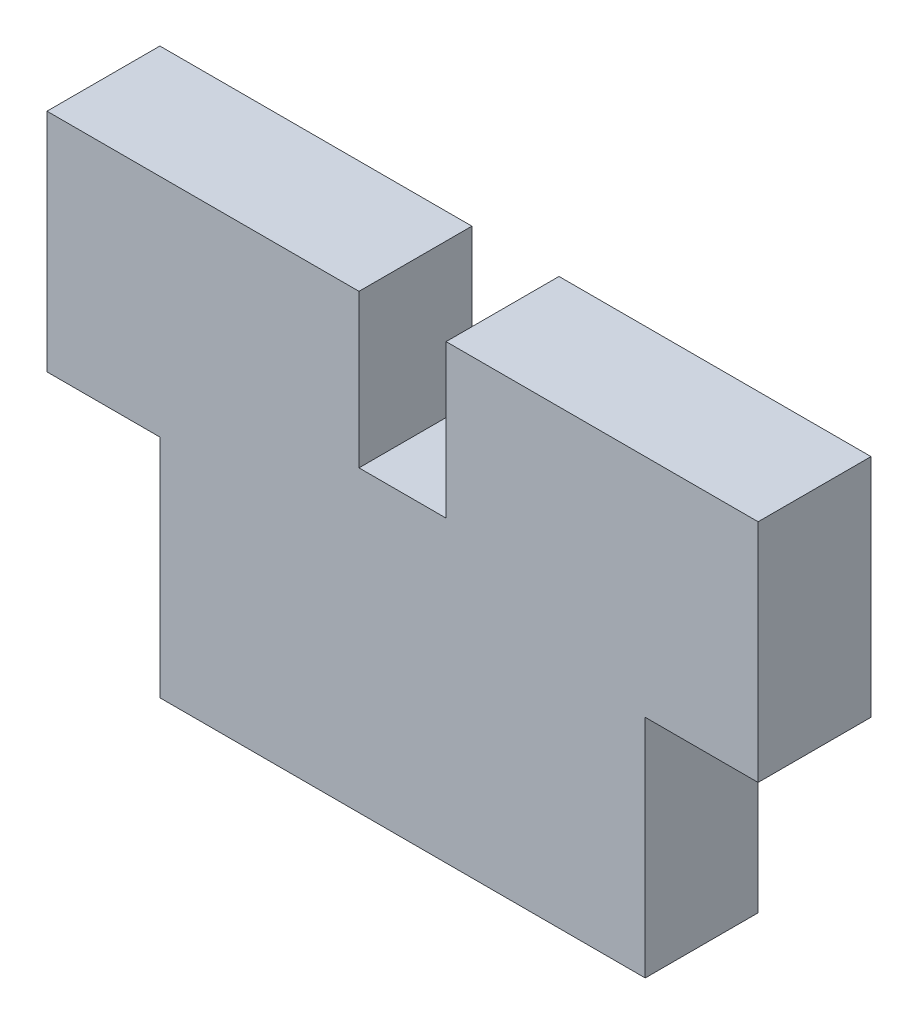
ISO-10303-21;
HEADER;
FILE_DESCRIPTION(('STEP AP214'),'2;1');
FILE_NAME('part.step','',(''),(''),'','','');
FILE_SCHEMA(('AUTOMOTIVE_DESIGN { 1 0 10303 214 1 1 1 1 }'));
ENDSEC;
DATA;
#1=APPLICATION_CONTEXT('core data for automotive mechanical design processes');
#2=APPLICATION_PROTOCOL_DEFINITION('international standard','automotive_design',2000,#1);
#3=PRODUCT_CONTEXT('',#1,'mechanical');
#4=PRODUCT('Part','Part','',(#3));
#5=PRODUCT_RELATED_PRODUCT_CATEGORY('part','',(#4));
#6=PRODUCT_DEFINITION_FORMATION('','',#4);
#7=PRODUCT_DEFINITION_CONTEXT('part definition',#1,'design');
#8=PRODUCT_DEFINITION('design','',#6,#7);
#9=PRODUCT_DEFINITION_SHAPE('','',#8);
#10=(LENGTH_UNIT() NAMED_UNIT(*) SI_UNIT(.MILLI.,.METRE.));
#11=(NAMED_UNIT(*) PLANE_ANGLE_UNIT() SI_UNIT($,.RADIAN.));
#12=(NAMED_UNIT(*) SI_UNIT($,.STERADIAN.) SOLID_ANGLE_UNIT());
#13=UNCERTAINTY_MEASURE_WITH_UNIT(LENGTH_MEASURE(1.E-05),#10,'distance_accuracy_value','');
#14=(GEOMETRIC_REPRESENTATION_CONTEXT(3) GLOBAL_UNCERTAINTY_ASSIGNED_CONTEXT((#13)) GLOBAL_UNIT_ASSIGNED_CONTEXT((#10,
#11,#12)) REPRESENTATION_CONTEXT('',''));
#15=CARTESIAN_POINT('',(0.,0.,0.));
#16=DIRECTION('',(0.,0.,1.));
#17=DIRECTION('',(1.,0.,0.));
#18=AXIS2_PLACEMENT_3D('',#15,#16,#17);
#19=CARTESIAN_POINT('',(-20.,6.35,6.35));
#20=DIRECTION('',(0.,-1.,0.));
#21=DIRECTION('',(0.,0.,-1.));
#22=AXIS2_PLACEMENT_3D('',#19,#20,#21);
#23=PLANE('',#22);
#24=DIRECTION('',(-1.,0.,0.));
#25=VECTOR('',#24,1.);
#26=CARTESIAN_POINT('',(-20.,6.35,0.));
#27=LINE('',#26,#25);
#28=CARTESIAN_POINT('',(20.,6.35,0.));
#29=VERTEX_POINT('',#28);
#30=CARTESIAN_POINT('',(2.45,6.35,0.));
#31=VERTEX_POINT('',#30);
#32=EDGE_CURVE('E200',#29,#31,#27,.T.);
#33=ORIENTED_EDGE('',*,*,#32,.T.);
#34=DIRECTION('',(0.,0.,-1.));
#35=VECTOR('',#34,1.);
#36=CARTESIAN_POINT('',(2.45,6.35,6.35));
#37=LINE('',#36,#35);
#38=CARTESIAN_POINT('',(2.45,6.35,6.35));
#39=VERTEX_POINT('',#38);
#40=EDGE_CURVE('E373',#39,#31,#37,.T.);
#41=ORIENTED_EDGE('',*,*,#40,.F.);
#42=DIRECTION('',(-1.,0.,0.));
#43=VECTOR('',#42,1.);
#44=CARTESIAN_POINT('',(-20.,6.35,6.35));
#45=LINE('',#44,#43);
#46=CARTESIAN_POINT('',(20.,6.35,6.35));
#47=VERTEX_POINT('',#46);
#48=EDGE_CURVE('E233',#47,#39,#45,.T.);
#49=ORIENTED_EDGE('',*,*,#48,.F.);
#50=DIRECTION('',(0.,0.,-1.));
#51=VECTOR('',#50,1.);
#52=CARTESIAN_POINT('',(20.,6.35,6.35));
#53=LINE('',#52,#51);
#54=EDGE_CURVE('E11',#47,#29,#53,.T.);
#55=ORIENTED_EDGE('',*,*,#54,.T.);
#56=EDGE_LOOP('',(#33,#41,#49,#55));
#57=FACE_BOUND('',#56,.T.);
#58=ADVANCED_FACE('F32',(#57),#23,.F.);
#59=CARTESIAN_POINT('',(-20.,-6.35,6.35));
#60=DIRECTION('',(0.,1.,0.));
#61=DIRECTION('',(0.,0.,1.));
#62=AXIS2_PLACEMENT_3D('',#59,#60,#61);
#63=PLANE('',#62);
#64=DIRECTION('',(0.,0.,1.));
#65=VECTOR('',#64,1.);
#66=CARTESIAN_POINT('',(13.65,-6.35,0.));
#67=LINE('',#66,#65);
#68=CARTESIAN_POINT('',(13.65,-6.35,0.));
#69=VERTEX_POINT('',#68);
#70=CARTESIAN_POINT('',(13.65,-6.35,6.35));
#71=VERTEX_POINT('',#70);
#72=EDGE_CURVE('E166',#69,#71,#67,.T.);
#73=ORIENTED_EDGE('',*,*,#72,.F.);
#74=DIRECTION('',(1.,0.,0.));
#75=VECTOR('',#74,1.);
#76=CARTESIAN_POINT('',(-20.,-6.35,0.));
#77=LINE('',#76,#75);
#78=CARTESIAN_POINT('',(20.,-6.35,0.));
#79=VERTEX_POINT('',#78);
#80=EDGE_CURVE('E209',#69,#79,#77,.T.);
#81=ORIENTED_EDGE('',*,*,#80,.T.);
#82=DIRECTION('',(0.,0.,-1.));
#83=VECTOR('',#82,1.);
#84=CARTESIAN_POINT('',(20.,-6.35,6.35));
#85=LINE('',#84,#83);
#86=CARTESIAN_POINT('',(20.,-6.35,6.35));
#87=VERTEX_POINT('',#86);
#88=EDGE_CURVE('E212',#87,#79,#85,.T.);
#89=ORIENTED_EDGE('',*,*,#88,.F.);
#90=DIRECTION('',(1.,0.,0.));
#91=VECTOR('',#90,1.);
#92=CARTESIAN_POINT('',(-20.,-6.35,6.35));
#93=LINE('',#92,#91);
#94=EDGE_CURVE('E57',#71,#87,#93,.T.);
#95=ORIENTED_EDGE('',*,*,#94,.F.);
#96=EDGE_LOOP('',(#73,#81,#89,#95));
#97=FACE_BOUND('',#96,.T.);
#98=ADVANCED_FACE('F254',(#97),#63,.F.);
#99=DIRECTION('',(0.,0.,-1.));
#100=VECTOR('',#99,1.);
#101=CARTESIAN_POINT('',(-13.65,-6.35,0.));
#102=LINE('',#101,#100);
#103=CARTESIAN_POINT('',(-13.65,-6.35,6.35));
#104=VERTEX_POINT('',#103);
#105=CARTESIAN_POINT('',(-13.65,-6.35,0.));
#106=VERTEX_POINT('',#105);
#107=EDGE_CURVE('E154',#104,#106,#102,.T.);
#108=ORIENTED_EDGE('',*,*,#107,.F.);
#109=CARTESIAN_POINT('',(-20.,-6.35,6.35));
#110=VERTEX_POINT('',#109);
#111=EDGE_CURVE('E227',#110,#104,#93,.T.);
#112=ORIENTED_EDGE('',*,*,#111,.F.);
#113=DIRECTION('',(0.,0.,-1.));
#114=VECTOR('',#113,1.);
#115=CARTESIAN_POINT('',(-20.,-6.35,6.35));
#116=LINE('',#115,#114);
#117=CARTESIAN_POINT('',(-20.,-6.35,0.));
#118=VERTEX_POINT('',#117);
#119=EDGE_CURVE('E222',#110,#118,#116,.T.);
#120=ORIENTED_EDGE('',*,*,#119,.T.);
#121=EDGE_CURVE('E218',#118,#106,#77,.T.);
#122=ORIENTED_EDGE('',*,*,#121,.T.);
#123=EDGE_LOOP('',(#108,#112,#120,#122));
#124=FACE_BOUND('',#123,.T.);
#125=ADVANCED_FACE('F245',(#124),#63,.F.);
#126=CARTESIAN_POINT('',(20.,-6.35,6.35));
#127=DIRECTION('',(-1.,0.,0.));
#128=DIRECTION('',(0.,0.,1.));
#129=AXIS2_PLACEMENT_3D('',#126,#127,#128);
#130=PLANE('',#129);
#131=DIRECTION('',(0.,1.,0.));
#132=VECTOR('',#131,1.);
#133=CARTESIAN_POINT('',(20.,-6.35,0.));
#134=LINE('',#133,#132);
#135=EDGE_CURVE('E191',#79,#29,#134,.T.);
#136=ORIENTED_EDGE('',*,*,#135,.T.);
#137=ORIENTED_EDGE('',*,*,#54,.F.);
#138=DIRECTION('',(0.,1.,0.));
#139=VECTOR('',#138,1.);
#140=CARTESIAN_POINT('',(20.,-6.35,6.35));
#141=LINE('',#140,#139);
#142=EDGE_CURVE('E219',#87,#47,#141,.T.);
#143=ORIENTED_EDGE('',*,*,#142,.F.);
#144=ORIENTED_EDGE('',*,*,#88,.T.);
#145=EDGE_LOOP('',(#136,#137,#143,#144));
#146=FACE_BOUND('',#145,.T.);
#147=ADVANCED_FACE('F34',(#146),#130,.F.);
#148=CARTESIAN_POINT('',(-2.45,6.35,6.35));
#149=VERTEX_POINT('',#148);
#150=CARTESIAN_POINT('',(-20.,6.35,6.35));
#151=VERTEX_POINT('',#150);
#152=EDGE_CURVE('E236',#149,#151,#45,.T.);
#153=ORIENTED_EDGE('',*,*,#152,.F.);
#154=DIRECTION('',(0.,0.,1.));
#155=VECTOR('',#154,1.);
#156=CARTESIAN_POINT('',(-2.45,6.35,6.35));
#157=LINE('',#156,#155);
#158=CARTESIAN_POINT('',(-2.45,6.35,0.));
#159=VERTEX_POINT('',#158);
#160=EDGE_CURVE('E375',#159,#149,#157,.T.);
#161=ORIENTED_EDGE('',*,*,#160,.F.);
#162=CARTESIAN_POINT('',(-20.,6.35,0.));
#163=VERTEX_POINT('',#162);
#164=EDGE_CURVE('E142',#159,#163,#27,.T.);
#165=ORIENTED_EDGE('',*,*,#164,.T.);
#166=DIRECTION('',(0.,0.,-1.));
#167=VECTOR('',#166,1.);
#168=CARTESIAN_POINT('',(-20.,6.35,6.35));
#169=LINE('',#168,#167);
#170=EDGE_CURVE('E41',#151,#163,#169,.T.);
#171=ORIENTED_EDGE('',*,*,#170,.F.);
#172=EDGE_LOOP('',(#153,#161,#165,#171));
#173=FACE_BOUND('',#172,.T.);
#174=ADVANCED_FACE('F242',(#173),#23,.F.);
#175=CARTESIAN_POINT('',(-20.,-6.35,6.35));
#176=DIRECTION('',(1.,0.,0.));
#177=DIRECTION('',(0.,0.,-1.));
#178=AXIS2_PLACEMENT_3D('',#175,#176,#177);
#179=PLANE('',#178);
#180=DIRECTION('',(0.,-1.,0.));
#181=VECTOR('',#180,1.);
#182=CARTESIAN_POINT('',(-20.,-6.35,0.));
#183=LINE('',#182,#181);
#184=EDGE_CURVE('E207',#163,#118,#183,.T.);
#185=ORIENTED_EDGE('',*,*,#184,.T.);
#186=ORIENTED_EDGE('',*,*,#119,.F.);
#187=DIRECTION('',(0.,-1.,0.));
#188=VECTOR('',#187,1.);
#189=CARTESIAN_POINT('',(-20.,-6.35,6.35));
#190=LINE('',#189,#188);
#191=EDGE_CURVE('E231',#151,#110,#190,.T.);
#192=ORIENTED_EDGE('',*,*,#191,.F.);
#193=ORIENTED_EDGE('',*,*,#170,.T.);
#194=EDGE_LOOP('',(#185,#186,#192,#193));
#195=FACE_BOUND('',#194,.T.);
#196=ADVANCED_FACE('F244',(#195),#179,.F.);
#197=CARTESIAN_POINT('',(0.,0.,6.35));
#198=DIRECTION('',(0.,0.,-1.));
#199=DIRECTION('',(-1.,0.,0.));
#200=AXIS2_PLACEMENT_3D('',#197,#198,#199);
#201=PLANE('',#200);
#202=ORIENTED_EDGE('',*,*,#48,.T.);
#203=DIRECTION('',(0.,1.,0.));
#204=VECTOR('',#203,1.);
#205=CARTESIAN_POINT('',(2.45,-2.25,6.35));
#206=LINE('',#205,#204);
#207=CARTESIAN_POINT('',(2.45,-2.25,6.35));
#208=VERTEX_POINT('',#207);
#209=EDGE_CURVE('E145',#208,#39,#206,.T.);
#210=ORIENTED_EDGE('',*,*,#209,.F.);
#211=DIRECTION('',(1.,0.,0.));
#212=VECTOR('',#211,1.);
#213=CARTESIAN_POINT('',(-2.45,-2.25,6.35));
#214=LINE('',#213,#212);
#215=CARTESIAN_POINT('',(-2.45,-2.25,6.35));
#216=VERTEX_POINT('',#215);
#217=EDGE_CURVE('E131',#216,#208,#214,.T.);
#218=ORIENTED_EDGE('',*,*,#217,.F.);
#219=DIRECTION('',(0.,1.,0.));
#220=VECTOR('',#219,1.);
#221=CARTESIAN_POINT('',(-2.45,-2.25,6.35));
#222=LINE('',#221,#220);
#223=EDGE_CURVE('E129',#216,#149,#222,.T.);
#224=ORIENTED_EDGE('',*,*,#223,.T.);
#225=ORIENTED_EDGE('',*,*,#152,.T.);
#226=ORIENTED_EDGE('',*,*,#191,.T.);
#227=ORIENTED_EDGE('',*,*,#111,.T.);
#228=DIRECTION('',(0.,1.,0.));
#229=VECTOR('',#228,1.);
#230=CARTESIAN_POINT('',(-13.65,-19.05,6.35));
#231=LINE('',#230,#229);
#232=CARTESIAN_POINT('',(-13.65,-19.05,6.35));
#233=VERTEX_POINT('',#232);
#234=EDGE_CURVE('E177',#233,#104,#231,.T.);
#235=ORIENTED_EDGE('',*,*,#234,.F.);
#236=DIRECTION('',(-1.,0.,0.));
#237=VECTOR('',#236,1.);
#238=CARTESIAN_POINT('',(-13.65,-19.05,6.35));
#239=LINE('',#238,#237);
#240=CARTESIAN_POINT('',(13.65,-19.05,6.35));
#241=VERTEX_POINT('',#240);
#242=EDGE_CURVE('E153',#241,#233,#239,.T.);
#243=ORIENTED_EDGE('',*,*,#242,.F.);
#244=DIRECTION('',(0.,1.,0.));
#245=VECTOR('',#244,1.);
#246=CARTESIAN_POINT('',(13.65,-19.05,6.35));
#247=LINE('',#246,#245);
#248=EDGE_CURVE('E183',#241,#71,#247,.T.);
#249=ORIENTED_EDGE('',*,*,#248,.T.);
#250=ORIENTED_EDGE('',*,*,#94,.T.);
#251=ORIENTED_EDGE('',*,*,#142,.T.);
#252=EDGE_LOOP('',(#202,#210,#218,#224,#225,#226,#227,#235,#243,#249,#250,#251));
#253=FACE_BOUND('',#252,.T.);
#254=ADVANCED_FACE('F240',(#253),#201,.F.);
#255=CARTESIAN_POINT('',(0.,0.,0.));
#256=DIRECTION('',(0.,0.,-1.));
#257=DIRECTION('',(-1.,0.,0.));
#258=AXIS2_PLACEMENT_3D('',#255,#256,#257);
#259=PLANE('',#258);
#260=DIRECTION('',(0.,1.,0.));
#261=VECTOR('',#260,1.);
#262=CARTESIAN_POINT('',(2.45,-2.25,0.));
#263=LINE('',#262,#261);
#264=CARTESIAN_POINT('',(2.45,-2.25,0.));
#265=VERTEX_POINT('',#264);
#266=EDGE_CURVE('E143',#265,#31,#263,.T.);
#267=ORIENTED_EDGE('',*,*,#266,.T.);
#268=ORIENTED_EDGE('',*,*,#32,.F.);
#269=ORIENTED_EDGE('',*,*,#135,.F.);
#270=ORIENTED_EDGE('',*,*,#80,.F.);
#271=DIRECTION('',(0.,1.,0.));
#272=VECTOR('',#271,1.);
#273=CARTESIAN_POINT('',(13.65,-19.05,0.));
#274=LINE('',#273,#272);
#275=CARTESIAN_POINT('',(13.65,-19.05,0.));
#276=VERTEX_POINT('',#275);
#277=EDGE_CURVE('E160',#276,#69,#274,.T.);
#278=ORIENTED_EDGE('',*,*,#277,.F.);
#279=DIRECTION('',(1.,0.,0.));
#280=VECTOR('',#279,1.);
#281=CARTESIAN_POINT('',(-13.65,-19.05,0.));
#282=LINE('',#281,#280);
#283=CARTESIAN_POINT('',(-13.65,-19.05,0.));
#284=VERTEX_POINT('',#283);
#285=EDGE_CURVE('E158',#284,#276,#282,.T.);
#286=ORIENTED_EDGE('',*,*,#285,.F.);
#287=DIRECTION('',(0.,1.,0.));
#288=VECTOR('',#287,1.);
#289=CARTESIAN_POINT('',(-13.65,-19.05,0.));
#290=LINE('',#289,#288);
#291=EDGE_CURVE('E172',#284,#106,#290,.T.);
#292=ORIENTED_EDGE('',*,*,#291,.T.);
#293=ORIENTED_EDGE('',*,*,#121,.F.);
#294=ORIENTED_EDGE('',*,*,#184,.F.);
#295=ORIENTED_EDGE('',*,*,#164,.F.);
#296=DIRECTION('',(0.,1.,0.));
#297=VECTOR('',#296,1.);
#298=CARTESIAN_POINT('',(-2.45,-2.25,0.));
#299=LINE('',#298,#297);
#300=CARTESIAN_POINT('',(-2.45,-2.25,0.));
#301=VERTEX_POINT('',#300);
#302=EDGE_CURVE('E126',#301,#159,#299,.T.);
#303=ORIENTED_EDGE('',*,*,#302,.F.);
#304=DIRECTION('',(-1.,0.,0.));
#305=VECTOR('',#304,1.);
#306=CARTESIAN_POINT('',(-2.45,-2.25,0.));
#307=LINE('',#306,#305);
#308=EDGE_CURVE('E132',#265,#301,#307,.T.);
#309=ORIENTED_EDGE('',*,*,#308,.F.);
#310=EDGE_LOOP('',(#267,#268,#269,#270,#278,#286,#292,#293,#294,#295,#303,#309));
#311=FACE_BOUND('',#310,.T.);
#312=ADVANCED_FACE('F140',(#311),#259,.T.);
#313=CARTESIAN_POINT('',(13.65,-19.05,0.));
#314=DIRECTION('',(-1.,0.,0.));
#315=DIRECTION('',(0.,0.,1.));
#316=AXIS2_PLACEMENT_3D('',#313,#314,#315);
#317=PLANE('',#316);
#318=ORIENTED_EDGE('',*,*,#72,.T.);
#319=ORIENTED_EDGE('',*,*,#248,.F.);
#320=DIRECTION('',(0.,0.,1.));
#321=VECTOR('',#320,1.);
#322=CARTESIAN_POINT('',(13.65,-19.05,0.));
#323=LINE('',#322,#321);
#324=EDGE_CURVE('E150',#276,#241,#323,.T.);
#325=ORIENTED_EDGE('',*,*,#324,.F.);
#326=ORIENTED_EDGE('',*,*,#277,.T.);
#327=EDGE_LOOP('',(#318,#319,#325,#326));
#328=FACE_BOUND('',#327,.T.);
#329=ADVANCED_FACE('F252',(#328),#317,.F.);
#330=CARTESIAN_POINT('',(-13.65,-19.05,0.));
#331=DIRECTION('',(1.,0.,0.));
#332=DIRECTION('',(0.,0.,-1.));
#333=AXIS2_PLACEMENT_3D('',#330,#331,#332);
#334=PLANE('',#333);
#335=ORIENTED_EDGE('',*,*,#107,.T.);
#336=ORIENTED_EDGE('',*,*,#291,.F.);
#337=DIRECTION('',(0.,0.,-1.));
#338=VECTOR('',#337,1.);
#339=CARTESIAN_POINT('',(-13.65,-19.05,0.));
#340=LINE('',#339,#338);
#341=EDGE_CURVE('E156',#233,#284,#340,.T.);
#342=ORIENTED_EDGE('',*,*,#341,.F.);
#343=ORIENTED_EDGE('',*,*,#234,.T.);
#344=EDGE_LOOP('',(#335,#336,#342,#343));
#345=FACE_BOUND('',#344,.T.);
#346=ADVANCED_FACE('F248',(#345),#334,.F.);
#347=CARTESIAN_POINT('',(0.,-19.05,0.));
#348=DIRECTION('',(0.,1.,0.));
#349=DIRECTION('',(0.,0.,1.));
#350=AXIS2_PLACEMENT_3D('',#347,#348,#349);
#351=PLANE('',#350);
#352=ORIENTED_EDGE('',*,*,#324,.T.);
#353=ORIENTED_EDGE('',*,*,#242,.T.);
#354=ORIENTED_EDGE('',*,*,#341,.T.);
#355=ORIENTED_EDGE('',*,*,#285,.T.);
#356=EDGE_LOOP('',(#352,#353,#354,#355));
#357=FACE_BOUND('',#356,.T.);
#358=ADVANCED_FACE('F251',(#357),#351,.F.);
#359=CARTESIAN_POINT('',(2.45,-2.25,6.35));
#360=DIRECTION('',(1.,0.,0.));
#361=DIRECTION('',(0.,0.,-1.));
#362=AXIS2_PLACEMENT_3D('',#359,#360,#361);
#363=PLANE('',#362);
#364=ORIENTED_EDGE('',*,*,#40,.T.);
#365=ORIENTED_EDGE('',*,*,#266,.F.);
#366=DIRECTION('',(0.,0.,-1.));
#367=VECTOR('',#366,1.);
#368=CARTESIAN_POINT('',(2.45,-2.25,6.35));
#369=LINE('',#368,#367);
#370=EDGE_CURVE('E49',#208,#265,#369,.T.);
#371=ORIENTED_EDGE('',*,*,#370,.F.);
#372=ORIENTED_EDGE('',*,*,#209,.T.);
#373=EDGE_LOOP('',(#364,#365,#371,#372));
#374=FACE_BOUND('',#373,.T.);
#375=ADVANCED_FACE('F282',(#374),#363,.F.);
#376=CARTESIAN_POINT('',(-2.45,-2.25,6.35));
#377=DIRECTION('',(-1.,0.,0.));
#378=DIRECTION('',(0.,0.,1.));
#379=AXIS2_PLACEMENT_3D('',#376,#377,#378);
#380=PLANE('',#379);
#381=ORIENTED_EDGE('',*,*,#160,.T.);
#382=ORIENTED_EDGE('',*,*,#223,.F.);
#383=DIRECTION('',(0.,0.,1.));
#384=VECTOR('',#383,1.);
#385=CARTESIAN_POINT('',(-2.45,-2.25,6.35));
#386=LINE('',#385,#384);
#387=EDGE_CURVE('E123',#301,#216,#386,.T.);
#388=ORIENTED_EDGE('',*,*,#387,.F.);
#389=ORIENTED_EDGE('',*,*,#302,.T.);
#390=EDGE_LOOP('',(#381,#382,#388,#389));
#391=FACE_BOUND('',#390,.T.);
#392=ADVANCED_FACE('F124',(#391),#380,.F.);
#393=CARTESIAN_POINT('',(0.,-2.25,0.));
#394=DIRECTION('',(0.,-1.,0.));
#395=DIRECTION('',(0.,0.,-1.));
#396=AXIS2_PLACEMENT_3D('',#393,#394,#395);
#397=PLANE('',#396);
#398=ORIENTED_EDGE('',*,*,#370,.T.);
#399=ORIENTED_EDGE('',*,*,#308,.T.);
#400=ORIENTED_EDGE('',*,*,#387,.T.);
#401=ORIENTED_EDGE('',*,*,#217,.T.);
#402=EDGE_LOOP('',(#398,#399,#400,#401));
#403=FACE_BOUND('',#402,.T.);
#404=ADVANCED_FACE('F135',(#403),#397,.F.);
#405=CLOSED_SHELL('',(#58,#98,#125,#147,#174,#196,#254,#312,#329,#346,#358,#375,#392,#404));
#406=MANIFOLD_SOLID_BREP('B2',#405);
#407=ADVANCED_BREP_SHAPE_REPRESENTATION('',(#18,#406),#14);
#408=SHAPE_DEFINITION_REPRESENTATION(#9,#407);
ENDSEC;
END-ISO-10303-21;
